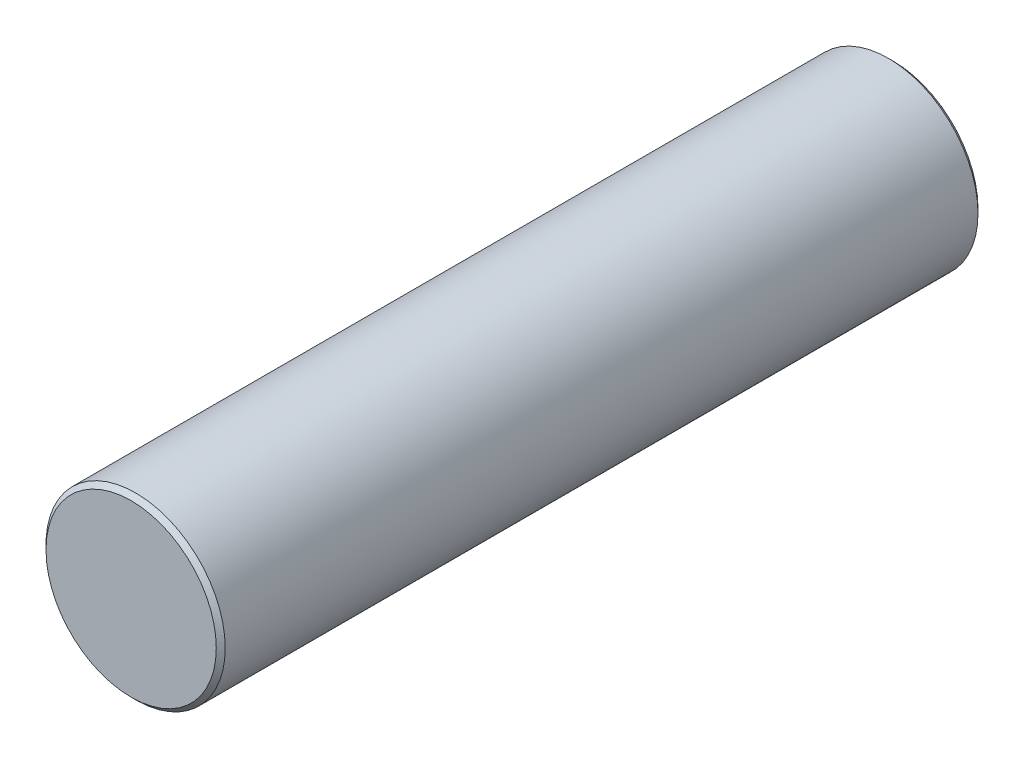
ISO-10303-21;
HEADER;
FILE_DESCRIPTION(('STEP AP214'),'2;1');
FILE_NAME('part.step','',(''),(''),'','','');
FILE_SCHEMA(('AUTOMOTIVE_DESIGN { 1 0 10303 214 1 1 1 1 }'));
ENDSEC;
DATA;
#1=APPLICATION_CONTEXT('core data for automotive mechanical design processes');
#2=APPLICATION_PROTOCOL_DEFINITION('international standard','automotive_design',2000,#1);
#3=PRODUCT_CONTEXT('',#1,'mechanical');
#4=PRODUCT('Part','Part','',(#3));
#5=PRODUCT_RELATED_PRODUCT_CATEGORY('part','',(#4));
#6=PRODUCT_DEFINITION_FORMATION('','',#4);
#7=PRODUCT_DEFINITION_CONTEXT('part definition',#1,'design');
#8=PRODUCT_DEFINITION('design','',#6,#7);
#9=PRODUCT_DEFINITION_SHAPE('','',#8);
#10=(LENGTH_UNIT() NAMED_UNIT(*) SI_UNIT(.MILLI.,.METRE.));
#11=(NAMED_UNIT(*) PLANE_ANGLE_UNIT() SI_UNIT($,.RADIAN.));
#12=(NAMED_UNIT(*) SI_UNIT($,.STERADIAN.) SOLID_ANGLE_UNIT());
#13=UNCERTAINTY_MEASURE_WITH_UNIT(LENGTH_MEASURE(1.E-05),#10,'distance_accuracy_value','');
#14=(GEOMETRIC_REPRESENTATION_CONTEXT(3) GLOBAL_UNCERTAINTY_ASSIGNED_CONTEXT((#13)) GLOBAL_UNIT_ASSIGNED_CONTEXT((#10,
#11,#12)) REPRESENTATION_CONTEXT('',''));
#15=CARTESIAN_POINT('',(0.,0.,0.));
#16=DIRECTION('',(0.,0.,1.));
#17=DIRECTION('',(1.,0.,0.));
#18=AXIS2_PLACEMENT_3D('',#15,#16,#17);
#19=CARTESIAN_POINT('',(0.,0.,170.));
#20=DIRECTION('',(0.,0.,-1.));
#21=DIRECTION('',(-1.,0.,0.));
#22=AXIS2_PLACEMENT_3D('',#19,#20,#21);
#23=CYLINDRICAL_SURFACE('',#22,20.);
#24=CARTESIAN_POINT('',(0.,0.,1.));
#25=DIRECTION('',(0.,0.,1.));
#26=DIRECTION('',(1.,0.,0.));
#27=AXIS2_PLACEMENT_3D('',#24,#25,#26);
#28=CIRCLE('',#27,20.);
#29=CARTESIAN_POINT('',(20.,0.,1.));
#30=VERTEX_POINT('',#29);
#31=EDGE_CURVE('E45',#30,#30,#28,.T.);
#32=ORIENTED_EDGE('',*,*,#31,.T.);
#33=EDGE_LOOP('',(#32));
#34=FACE_BOUND('',#33,.T.);
#35=CARTESIAN_POINT('',(0.,0.,169.));
#36=DIRECTION('',(0.,0.,1.));
#37=DIRECTION('',(1.,0.,0.));
#38=AXIS2_PLACEMENT_3D('',#35,#36,#37);
#39=CIRCLE('',#38,20.);
#40=CARTESIAN_POINT('',(20.,0.,169.));
#41=VERTEX_POINT('',#40);
#42=EDGE_CURVE('E49',#41,#41,#39,.F.);
#43=ORIENTED_EDGE('',*,*,#42,.T.);
#44=EDGE_LOOP('',(#43));
#45=FACE_BOUND('',#44,.T.);
#46=ADVANCED_FACE('F34',(#34,#45),#23,.T.);
#47=CARTESIAN_POINT('',(0.,0.,170.));
#48=DIRECTION('',(0.,0.,1.));
#49=DIRECTION('',(1.,0.,0.));
#50=AXIS2_PLACEMENT_3D('',#47,#48,#49);
#51=PLANE('',#50);
#52=CARTESIAN_POINT('',(0.,0.,170.));
#53=DIRECTION('',(0.,0.,1.));
#54=DIRECTION('',(1.,0.,0.));
#55=AXIS2_PLACEMENT_3D('',#52,#53,#54);
#56=CIRCLE('',#55,19.);
#57=CARTESIAN_POINT('',(19.,0.,170.));
#58=VERTEX_POINT('',#57);
#59=EDGE_CURVE('E10',#58,#58,#56,.T.);
#60=ORIENTED_EDGE('',*,*,#59,.T.);
#61=EDGE_LOOP('',(#60));
#62=FACE_BOUND('',#61,.T.);
#63=ADVANCED_FACE('F65',(#62),#51,.T.);
#64=CARTESIAN_POINT('',(0.,0.,0.));
#65=DIRECTION('',(0.,0.,1.));
#66=DIRECTION('',(1.,0.,0.));
#67=AXIS2_PLACEMENT_3D('',#64,#65,#66);
#68=PLANE('',#67);
#69=CARTESIAN_POINT('',(0.,0.,0.));
#70=DIRECTION('',(0.,0.,1.));
#71=DIRECTION('',(1.,0.,0.));
#72=AXIS2_PLACEMENT_3D('',#69,#70,#71);
#73=CIRCLE('',#72,19.);
#74=CARTESIAN_POINT('',(19.,0.,0.));
#75=VERTEX_POINT('',#74);
#76=EDGE_CURVE('E41',#75,#75,#73,.F.);
#77=ORIENTED_EDGE('',*,*,#76,.T.);
#78=EDGE_LOOP('',(#77));
#79=FACE_BOUND('',#78,.T.);
#80=ADVANCED_FACE('F62',(#79),#68,.F.);
#81=CARTESIAN_POINT('',(0.,0.,1.));
#82=DIRECTION('',(0.,0.,1.));
#83=DIRECTION('',(1.,0.,0.));
#84=AXIS2_PLACEMENT_3D('',#81,#82,#83);
#85=CONICAL_SURFACE('',#84,20.,0.78539816339744);
#86=ORIENTED_EDGE('',*,*,#76,.F.);
#87=EDGE_LOOP('',(#86));
#88=FACE_BOUND('',#87,.T.);
#89=ORIENTED_EDGE('',*,*,#31,.F.);
#90=EDGE_LOOP('',(#89));
#91=FACE_BOUND('',#90,.T.);
#92=ADVANCED_FACE('F58',(#88,#91),#85,.T.);
#93=CARTESIAN_POINT('',(0.,0.,170.));
#94=DIRECTION('',(0.,0.,-1.));
#95=DIRECTION('',(-1.,0.,0.));
#96=AXIS2_PLACEMENT_3D('',#93,#94,#95);
#97=CONICAL_SURFACE('',#96,19.,0.78539816339744);
#98=ORIENTED_EDGE('',*,*,#42,.F.);
#99=EDGE_LOOP('',(#98));
#100=FACE_BOUND('',#99,.T.);
#101=ORIENTED_EDGE('',*,*,#59,.F.);
#102=EDGE_LOOP('',(#101));
#103=FACE_BOUND('',#102,.T.);
#104=ADVANCED_FACE('F36',(#100,#103),#97,.T.);
#105=CLOSED_SHELL('',(#46,#63,#80,#92,#104));
#106=MANIFOLD_SOLID_BREP('B2',#105);
#107=ADVANCED_BREP_SHAPE_REPRESENTATION('',(#18,#106),#14);
#108=SHAPE_DEFINITION_REPRESENTATION(#9,#107);
ENDSEC;
END-ISO-10303-21;
